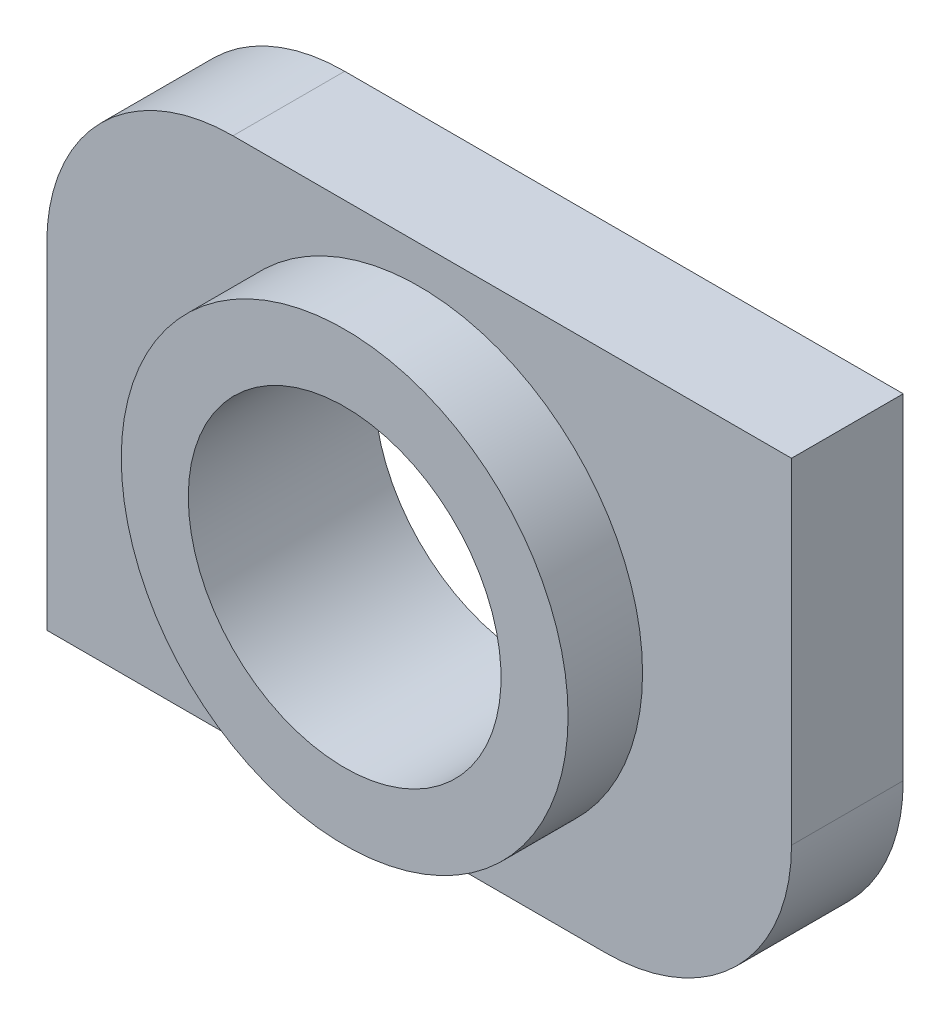
ISO-10303-21;
HEADER;
FILE_DESCRIPTION(('STEP AP214'),'2;1');
FILE_NAME('part.step','',(''),(''),'','','');
FILE_SCHEMA(('AUTOMOTIVE_DESIGN { 1 0 10303 214 1 1 1 1 }'));
ENDSEC;
DATA;
#1=APPLICATION_CONTEXT('core data for automotive mechanical design processes');
#2=APPLICATION_PROTOCOL_DEFINITION('international standard','automotive_design',2000,#1);
#3=PRODUCT_CONTEXT('',#1,'mechanical');
#4=PRODUCT('Part','Part','',(#3));
#5=PRODUCT_RELATED_PRODUCT_CATEGORY('part','',(#4));
#6=PRODUCT_DEFINITION_FORMATION('','',#4);
#7=PRODUCT_DEFINITION_CONTEXT('part definition',#1,'design');
#8=PRODUCT_DEFINITION('design','',#6,#7);
#9=PRODUCT_DEFINITION_SHAPE('','',#8);
#10=(LENGTH_UNIT() NAMED_UNIT(*) SI_UNIT(.MILLI.,.METRE.));
#11=(NAMED_UNIT(*) PLANE_ANGLE_UNIT() SI_UNIT($,.RADIAN.));
#12=(NAMED_UNIT(*) SI_UNIT($,.STERADIAN.) SOLID_ANGLE_UNIT());
#13=UNCERTAINTY_MEASURE_WITH_UNIT(LENGTH_MEASURE(1.E-05),#10,'distance_accuracy_value','');
#14=(GEOMETRIC_REPRESENTATION_CONTEXT(3) GLOBAL_UNCERTAINTY_ASSIGNED_CONTEXT((#13)) GLOBAL_UNIT_ASSIGNED_CONTEXT((#10,
#11,#12)) REPRESENTATION_CONTEXT('',''));
#15=CARTESIAN_POINT('',(0.,0.,0.));
#16=DIRECTION('',(0.,0.,1.));
#17=DIRECTION('',(1.,0.,0.));
#18=AXIS2_PLACEMENT_3D('',#15,#16,#17);
#19=CARTESIAN_POINT('',(0.,0.,2.5));
#20=DIRECTION('',(0.,0.,-1.));
#21=DIRECTION('',(-1.,0.,0.));
#22=AXIS2_PLACEMENT_3D('',#19,#20,#21);
#23=CYLINDRICAL_SURFACE('',#22,3.);
#24=CARTESIAN_POINT('',(0.,0.,2.5));
#25=DIRECTION('',(0.,0.,-1.));
#26=DIRECTION('',(-1.,0.,0.));
#27=AXIS2_PLACEMENT_3D('',#24,#25,#26);
#28=CIRCLE('',#27,3.);
#29=CARTESIAN_POINT('',(-3.,0.,2.5));
#30=VERTEX_POINT('',#29);
#31=EDGE_CURVE('E19',#30,#30,#28,.F.);
#32=ORIENTED_EDGE('',*,*,#31,.F.);
#33=EDGE_LOOP('',(#32));
#34=FACE_BOUND('',#33,.T.);
#35=CARTESIAN_POINT('',(0.,0.,1.5));
#36=DIRECTION('',(0.,0.,-1.));
#37=DIRECTION('',(-1.,0.,0.));
#38=AXIS2_PLACEMENT_3D('',#35,#36,#37);
#39=CIRCLE('',#38,3.);
#40=CARTESIAN_POINT('',(-3.,0.,1.5));
#41=VERTEX_POINT('',#40);
#42=EDGE_CURVE('E128',#41,#41,#39,.T.);
#43=ORIENTED_EDGE('',*,*,#42,.F.);
#44=EDGE_LOOP('',(#43));
#45=FACE_BOUND('',#44,.T.);
#46=ADVANCED_FACE('F16',(#34,#45),#23,.T.);
#47=CARTESIAN_POINT('',(0.,0.,2.5));
#48=DIRECTION('',(0.,0.,1.));
#49=DIRECTION('',(1.,0.,0.));
#50=AXIS2_PLACEMENT_3D('',#47,#48,#49);
#51=PLANE('',#50);
#52=ORIENTED_EDGE('',*,*,#31,.T.);
#53=EDGE_LOOP('',(#52));
#54=FACE_BOUND('',#53,.T.);
#55=CARTESIAN_POINT('',(0.,0.,2.5));
#56=DIRECTION('',(0.,0.,-1.));
#57=DIRECTION('',(-1.,0.,0.));
#58=AXIS2_PLACEMENT_3D('',#55,#56,#57);
#59=CIRCLE('',#58,2.1);
#60=CARTESIAN_POINT('',(-2.1,0.,2.5));
#61=VERTEX_POINT('',#60);
#62=EDGE_CURVE('E85',#61,#61,#59,.T.);
#63=ORIENTED_EDGE('',*,*,#62,.T.);
#64=EDGE_LOOP('',(#63));
#65=FACE_BOUND('',#64,.T.);
#66=ADVANCED_FACE('F134',(#54,#65),#51,.T.);
#67=CARTESIAN_POINT('',(-5.,-3.5,1.5));
#68=DIRECTION('',(0.,0.,1.));
#69=DIRECTION('',(1.,0.,0.));
#70=AXIS2_PLACEMENT_3D('',#67,#68,#69);
#71=PLANE('',#70);
#72=DIRECTION('',(0.,-1.,0.));
#73=VECTOR('',#72,1.);
#74=CARTESIAN_POINT('',(5.,3.5,1.5));
#75=LINE('',#74,#73);
#76=CARTESIAN_POINT('',(5.,-0.999999999999999,1.5));
#77=VERTEX_POINT('',#76);
#78=CARTESIAN_POINT('',(5.,3.5,1.5));
#79=VERTEX_POINT('',#78);
#80=EDGE_CURVE('E72',#77,#79,#75,.F.);
#81=ORIENTED_EDGE('',*,*,#80,.T.);
#82=DIRECTION('',(1.,0.,0.));
#83=VECTOR('',#82,1.);
#84=CARTESIAN_POINT('',(-5.,3.5,1.5));
#85=LINE('',#84,#83);
#86=CARTESIAN_POINT('',(-2.5,3.5,1.5));
#87=VERTEX_POINT('',#86);
#88=EDGE_CURVE('E76',#79,#87,#85,.F.);
#89=ORIENTED_EDGE('',*,*,#88,.T.);
#90=CARTESIAN_POINT('',(-2.5,1.,1.5));
#91=DIRECTION('',(0.,0.,-1.));
#92=DIRECTION('',(-1.,0.,0.));
#93=AXIS2_PLACEMENT_3D('',#90,#91,#92);
#94=CIRCLE('',#93,2.5);
#95=CARTESIAN_POINT('',(-5.,1.,1.5));
#96=VERTEX_POINT('',#95);
#97=EDGE_CURVE('E67',#96,#87,#94,.T.);
#98=ORIENTED_EDGE('',*,*,#97,.F.);
#99=DIRECTION('',(0.,1.,0.));
#100=VECTOR('',#99,1.);
#101=CARTESIAN_POINT('',(-5.,3.5,1.5));
#102=LINE('',#101,#100);
#103=CARTESIAN_POINT('',(-5.,-3.5,1.5));
#104=VERTEX_POINT('',#103);
#105=EDGE_CURVE('E61',#96,#104,#102,.F.);
#106=ORIENTED_EDGE('',*,*,#105,.T.);
#107=DIRECTION('',(-1.,0.,0.));
#108=VECTOR('',#107,1.);
#109=CARTESIAN_POINT('',(-5.,-3.5,1.5));
#110=LINE('',#109,#108);
#111=CARTESIAN_POINT('',(2.5,-3.5,1.5));
#112=VERTEX_POINT('',#111);
#113=EDGE_CURVE('E103',#104,#112,#110,.F.);
#114=ORIENTED_EDGE('',*,*,#113,.T.);
#115=CARTESIAN_POINT('',(2.5,-0.999999999999999,1.5));
#116=DIRECTION('',(0.,0.,-1.));
#117=DIRECTION('',(-1.,0.,0.));
#118=AXIS2_PLACEMENT_3D('',#115,#116,#117);
#119=CIRCLE('',#118,2.5);
#120=EDGE_CURVE('E79',#77,#112,#119,.T.);
#121=ORIENTED_EDGE('',*,*,#120,.F.);
#122=EDGE_LOOP('',(#81,#89,#98,#106,#114,#121));
#123=FACE_BOUND('',#122,.T.);
#124=ORIENTED_EDGE('',*,*,#42,.T.);
#125=EDGE_LOOP('',(#124));
#126=FACE_BOUND('',#125,.T.);
#127=ADVANCED_FACE('F74',(#123,#126),#71,.T.);
#128=CARTESIAN_POINT('',(0.,0.,1.5));
#129=DIRECTION('',(0.,0.,-1.));
#130=DIRECTION('',(-1.,0.,0.));
#131=AXIS2_PLACEMENT_3D('',#128,#129,#130);
#132=CYLINDRICAL_SURFACE('',#131,2.1);
#133=ORIENTED_EDGE('',*,*,#62,.F.);
#134=EDGE_LOOP('',(#133));
#135=FACE_BOUND('',#134,.T.);
#136=CARTESIAN_POINT('',(0.,0.,0.));
#137=DIRECTION('',(0.,0.,-1.));
#138=DIRECTION('',(-1.,0.,0.));
#139=AXIS2_PLACEMENT_3D('',#136,#137,#138);
#140=CIRCLE('',#139,2.1);
#141=CARTESIAN_POINT('',(-2.1,0.,0.));
#142=VERTEX_POINT('',#141);
#143=EDGE_CURVE('E122',#142,#142,#140,.T.);
#144=ORIENTED_EDGE('',*,*,#143,.T.);
#145=EDGE_LOOP('',(#144));
#146=FACE_BOUND('',#145,.T.);
#147=ADVANCED_FACE('F169',(#135,#146),#132,.F.);
#148=CARTESIAN_POINT('',(5.,3.5,1.5));
#149=DIRECTION('',(-1.,0.,0.));
#150=DIRECTION('',(0.,-1.,0.));
#151=AXIS2_PLACEMENT_3D('',#148,#149,#150);
#152=PLANE('',#151);
#153=DIRECTION('',(0.,1.,0.));
#154=VECTOR('',#153,1.);
#155=CARTESIAN_POINT('',(5.,-3.5,0.));
#156=LINE('',#155,#154);
#157=CARTESIAN_POINT('',(5.,-0.999999999999999,0.));
#158=VERTEX_POINT('',#157);
#159=CARTESIAN_POINT('',(5.,3.5,0.));
#160=VERTEX_POINT('',#159);
#161=EDGE_CURVE('E96',#158,#160,#156,.T.);
#162=ORIENTED_EDGE('',*,*,#161,.T.);
#163=DIRECTION('',(0.,0.,-1.));
#164=VECTOR('',#163,1.);
#165=CARTESIAN_POINT('',(5.,3.5,1.5));
#166=LINE('',#165,#164);
#167=EDGE_CURVE('E84',#160,#79,#166,.F.);
#168=ORIENTED_EDGE('',*,*,#167,.T.);
#169=ORIENTED_EDGE('',*,*,#80,.F.);
#170=DIRECTION('',(0.,0.,-1.));
#171=VECTOR('',#170,1.);
#172=CARTESIAN_POINT('',(5.,-0.999999999999999,1.5));
#173=LINE('',#172,#171);
#174=EDGE_CURVE('E105',#158,#77,#173,.F.);
#175=ORIENTED_EDGE('',*,*,#174,.F.);
#176=EDGE_LOOP('',(#162,#168,#169,#175));
#177=FACE_BOUND('',#176,.T.);
#178=ADVANCED_FACE('F95',(#177),#152,.F.);
#179=CARTESIAN_POINT('',(-5.,3.5,1.5));
#180=DIRECTION('',(0.,-1.,0.));
#181=DIRECTION('',(0.,0.,-1.));
#182=AXIS2_PLACEMENT_3D('',#179,#180,#181);
#183=PLANE('',#182);
#184=ORIENTED_EDGE('',*,*,#88,.F.);
#185=ORIENTED_EDGE('',*,*,#167,.F.);
#186=DIRECTION('',(1.,0.,0.));
#187=VECTOR('',#186,1.);
#188=CARTESIAN_POINT('',(-5.,3.5,0.));
#189=LINE('',#188,#187);
#190=CARTESIAN_POINT('',(-2.5,3.5,0.));
#191=VERTEX_POINT('',#190);
#192=EDGE_CURVE('E121',#160,#191,#189,.F.);
#193=ORIENTED_EDGE('',*,*,#192,.T.);
#194=DIRECTION('',(0.,0.,-1.));
#195=VECTOR('',#194,1.);
#196=CARTESIAN_POINT('',(-2.5,3.5,1.5));
#197=LINE('',#196,#195);
#198=EDGE_CURVE('E92',#87,#191,#197,.T.);
#199=ORIENTED_EDGE('',*,*,#198,.F.);
#200=EDGE_LOOP('',(#184,#185,#193,#199));
#201=FACE_BOUND('',#200,.T.);
#202=ADVANCED_FACE('F89',(#201),#183,.F.);
#203=CARTESIAN_POINT('',(-2.5,1.,1.5));
#204=DIRECTION('',(0.,0.,-1.));
#205=DIRECTION('',(-1.,0.,0.));
#206=AXIS2_PLACEMENT_3D('',#203,#204,#205);
#207=CYLINDRICAL_SURFACE('',#206,2.5);
#208=ORIENTED_EDGE('',*,*,#97,.T.);
#209=ORIENTED_EDGE('',*,*,#198,.T.);
#210=CARTESIAN_POINT('',(-2.5,1.,0.));
#211=DIRECTION('',(0.,0.,-1.));
#212=DIRECTION('',(-1.,0.,0.));
#213=AXIS2_PLACEMENT_3D('',#210,#211,#212);
#214=CIRCLE('',#213,2.5);
#215=CARTESIAN_POINT('',(-5.,1.,0.));
#216=VERTEX_POINT('',#215);
#217=EDGE_CURVE('E117',#191,#216,#214,.F.);
#218=ORIENTED_EDGE('',*,*,#217,.T.);
#219=DIRECTION('',(0.,0.,1.));
#220=VECTOR('',#219,1.);
#221=CARTESIAN_POINT('',(-5.,1.,1.5));
#222=LINE('',#221,#220);
#223=EDGE_CURVE('E112',#216,#96,#222,.T.);
#224=ORIENTED_EDGE('',*,*,#223,.T.);
#225=EDGE_LOOP('',(#208,#209,#218,#224));
#226=FACE_BOUND('',#225,.T.);
#227=ADVANCED_FACE('F162',(#226),#207,.T.);
#228=CARTESIAN_POINT('',(-5.,3.5,1.5));
#229=DIRECTION('',(1.,0.,0.));
#230=DIRECTION('',(0.,1.,0.));
#231=AXIS2_PLACEMENT_3D('',#228,#229,#230);
#232=PLANE('',#231);
#233=DIRECTION('',(0.,1.,0.));
#234=VECTOR('',#233,1.);
#235=CARTESIAN_POINT('',(-5.,-3.5,0.));
#236=LINE('',#235,#234);
#237=CARTESIAN_POINT('',(-5.,-3.5,0.));
#238=VERTEX_POINT('',#237);
#239=EDGE_CURVE('E120',#216,#238,#236,.F.);
#240=ORIENTED_EDGE('',*,*,#239,.T.);
#241=DIRECTION('',(0.,0.,1.));
#242=VECTOR('',#241,1.);
#243=CARTESIAN_POINT('',(-5.,-3.5,1.5));
#244=LINE('',#243,#242);
#245=EDGE_CURVE('E106',#238,#104,#244,.T.);
#246=ORIENTED_EDGE('',*,*,#245,.T.);
#247=ORIENTED_EDGE('',*,*,#105,.F.);
#248=ORIENTED_EDGE('',*,*,#223,.F.);
#249=EDGE_LOOP('',(#240,#246,#247,#248));
#250=FACE_BOUND('',#249,.T.);
#251=ADVANCED_FACE('F158',(#250),#232,.F.);
#252=CARTESIAN_POINT('',(-5.,-3.5,1.5));
#253=DIRECTION('',(0.,1.,0.));
#254=DIRECTION('',(-1.,0.,0.));
#255=AXIS2_PLACEMENT_3D('',#252,#253,#254);
#256=PLANE('',#255);
#257=ORIENTED_EDGE('',*,*,#113,.F.);
#258=ORIENTED_EDGE('',*,*,#245,.F.);
#259=DIRECTION('',(1.,0.,0.));
#260=VECTOR('',#259,1.);
#261=CARTESIAN_POINT('',(-5.,-3.5,0.));
#262=LINE('',#261,#260);
#263=CARTESIAN_POINT('',(2.5,-3.5,0.));
#264=VERTEX_POINT('',#263);
#265=EDGE_CURVE('E25',#238,#264,#262,.T.);
#266=ORIENTED_EDGE('',*,*,#265,.T.);
#267=DIRECTION('',(0.,0.,-1.));
#268=VECTOR('',#267,1.);
#269=CARTESIAN_POINT('',(2.5,-3.5,1.5));
#270=LINE('',#269,#268);
#271=EDGE_CURVE('E33',#112,#264,#270,.T.);
#272=ORIENTED_EDGE('',*,*,#271,.F.);
#273=EDGE_LOOP('',(#257,#258,#266,#272));
#274=FACE_BOUND('',#273,.T.);
#275=ADVANCED_FACE('F151',(#274),#256,.F.);
#276=CARTESIAN_POINT('',(2.5,-0.999999999999999,1.5));
#277=DIRECTION('',(0.,0.,-1.));
#278=DIRECTION('',(-1.,0.,0.));
#279=AXIS2_PLACEMENT_3D('',#276,#277,#278);
#280=CYLINDRICAL_SURFACE('',#279,2.5);
#281=ORIENTED_EDGE('',*,*,#120,.T.);
#282=ORIENTED_EDGE('',*,*,#271,.T.);
#283=CARTESIAN_POINT('',(2.5,-0.999999999999999,0.));
#284=DIRECTION('',(0.,0.,-1.));
#285=DIRECTION('',(-1.,0.,0.));
#286=AXIS2_PLACEMENT_3D('',#283,#284,#285);
#287=CIRCLE('',#286,2.5);
#288=EDGE_CURVE('E11',#264,#158,#287,.F.);
#289=ORIENTED_EDGE('',*,*,#288,.T.);
#290=ORIENTED_EDGE('',*,*,#174,.T.);
#291=EDGE_LOOP('',(#281,#282,#289,#290));
#292=FACE_BOUND('',#291,.T.);
#293=ADVANCED_FACE('F145',(#292),#280,.T.);
#294=CARTESIAN_POINT('',(-5.,-3.5,0.));
#295=DIRECTION('',(0.,0.,1.));
#296=DIRECTION('',(1.,0.,0.));
#297=AXIS2_PLACEMENT_3D('',#294,#295,#296);
#298=PLANE('',#297);
#299=ORIENTED_EDGE('',*,*,#265,.F.);
#300=ORIENTED_EDGE('',*,*,#239,.F.);
#301=ORIENTED_EDGE('',*,*,#217,.F.);
#302=ORIENTED_EDGE('',*,*,#192,.F.);
#303=ORIENTED_EDGE('',*,*,#161,.F.);
#304=ORIENTED_EDGE('',*,*,#288,.F.);
#305=EDGE_LOOP('',(#299,#300,#301,#302,#303,#304));
#306=FACE_BOUND('',#305,.T.);
#307=ORIENTED_EDGE('',*,*,#143,.F.);
#308=EDGE_LOOP('',(#307));
#309=FACE_BOUND('',#308,.T.);
#310=ADVANCED_FACE('F143',(#306,#309),#298,.F.);
#311=CLOSED_SHELL('',(#46,#66,#127,#147,#178,#202,#227,#251,#275,#293,#310));
#312=MANIFOLD_SOLID_BREP('B1',#311);
#313=ADVANCED_BREP_SHAPE_REPRESENTATION('',(#18,#312),#14);
#314=SHAPE_DEFINITION_REPRESENTATION(#9,#313);
ENDSEC;
END-ISO-10303-21;
